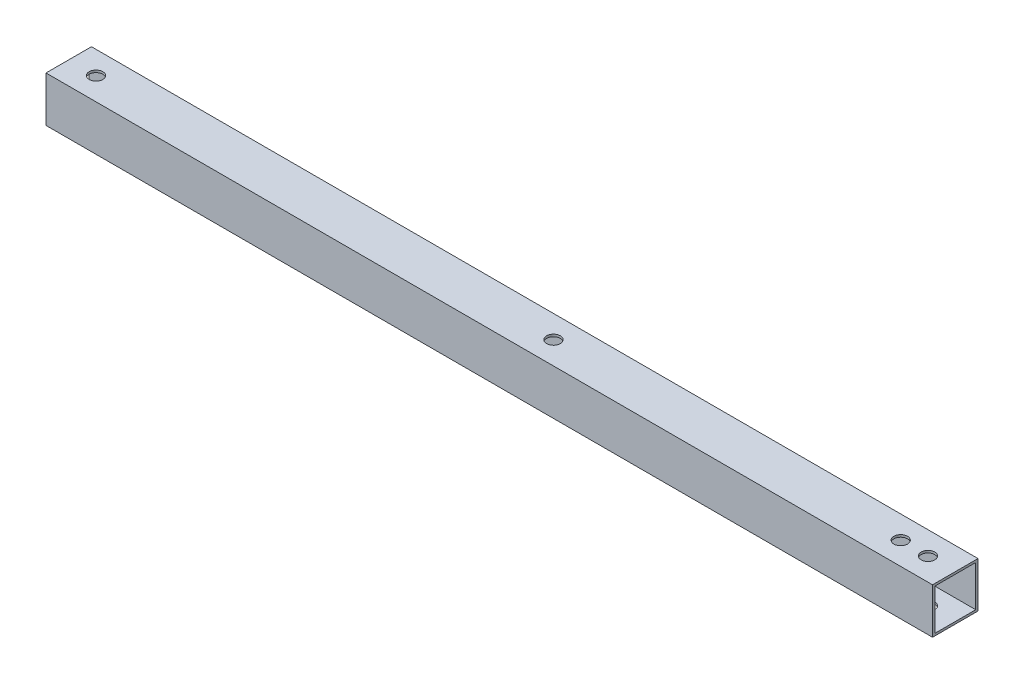
ISO-10303-21;
HEADER;
FILE_DESCRIPTION(('STEP AP214'),'2;1');
FILE_NAME('part.step','',(''),(''),'','','');
FILE_SCHEMA(('AUTOMOTIVE_DESIGN { 1 0 10303 214 1 1 1 1 }'));
ENDSEC;
DATA;
#1=APPLICATION_CONTEXT('core data for automotive mechanical design processes');
#2=APPLICATION_PROTOCOL_DEFINITION('international standard','automotive_design',2000,#1);
#3=PRODUCT_CONTEXT('',#1,'mechanical');
#4=PRODUCT('Part','Part','',(#3));
#5=PRODUCT_RELATED_PRODUCT_CATEGORY('part','',(#4));
#6=PRODUCT_DEFINITION_FORMATION('','',#4);
#7=PRODUCT_DEFINITION_CONTEXT('part definition',#1,'design');
#8=PRODUCT_DEFINITION('design','',#6,#7);
#9=PRODUCT_DEFINITION_SHAPE('','',#8);
#10=(LENGTH_UNIT() NAMED_UNIT(*) SI_UNIT(.MILLI.,.METRE.));
#11=(NAMED_UNIT(*) PLANE_ANGLE_UNIT() SI_UNIT($,.RADIAN.));
#12=(NAMED_UNIT(*) SI_UNIT($,.STERADIAN.) SOLID_ANGLE_UNIT());
#13=UNCERTAINTY_MEASURE_WITH_UNIT(LENGTH_MEASURE(1.E-05),#10,'distance_accuracy_value','');
#14=(GEOMETRIC_REPRESENTATION_CONTEXT(3) GLOBAL_UNCERTAINTY_ASSIGNED_CONTEXT((#13)) GLOBAL_UNIT_ASSIGNED_CONTEXT((#10,
#11,#12)) REPRESENTATION_CONTEXT('',''));
#15=CARTESIAN_POINT('',(0.,0.,0.));
#16=DIRECTION('',(0.,0.,1.));
#17=DIRECTION('',(1.,0.,0.));
#18=AXIS2_PLACEMENT_3D('',#15,#16,#17);
#19=CARTESIAN_POINT('',(390.,0.,0.));
#20=DIRECTION('',(-1.,0.,0.));
#21=DIRECTION('',(0.,0.,1.));
#22=AXIS2_PLACEMENT_3D('',#19,#20,#21);
#23=PLANE('',#22);
#24=DIRECTION('',(0.,1.,0.));
#25=VECTOR('',#24,1.);
#26=CARTESIAN_POINT('',(390.,-10.,-10.));
#27=LINE('',#26,#25);
#28=CARTESIAN_POINT('',(390.,-10.,-10.));
#29=VERTEX_POINT('',#28);
#30=CARTESIAN_POINT('',(390.,10.,-10.));
#31=VERTEX_POINT('',#30);
#32=EDGE_CURVE('E157',#29,#31,#27,.T.);
#33=ORIENTED_EDGE('',*,*,#32,.T.);
#34=DIRECTION('',(0.,0.,1.));
#35=VECTOR('',#34,1.);
#36=CARTESIAN_POINT('',(390.,10.,10.));
#37=LINE('',#36,#35);
#38=CARTESIAN_POINT('',(390.,10.,10.));
#39=VERTEX_POINT('',#38);
#40=EDGE_CURVE('E161',#31,#39,#37,.T.);
#41=ORIENTED_EDGE('',*,*,#40,.T.);
#42=DIRECTION('',(0.,-1.,0.));
#43=VECTOR('',#42,1.);
#44=CARTESIAN_POINT('',(390.,-10.,10.));
#45=LINE('',#44,#43);
#46=CARTESIAN_POINT('',(390.,-10.,10.));
#47=VERTEX_POINT('',#46);
#48=EDGE_CURVE('E165',#39,#47,#45,.T.);
#49=ORIENTED_EDGE('',*,*,#48,.T.);
#50=DIRECTION('',(0.,0.,-1.));
#51=VECTOR('',#50,1.);
#52=CARTESIAN_POINT('',(390.,-10.,10.));
#53=LINE('',#52,#51);
#54=EDGE_CURVE('E168',#47,#29,#53,.T.);
#55=ORIENTED_EDGE('',*,*,#54,.T.);
#56=EDGE_LOOP('',(#33,#41,#49,#55));
#57=FACE_BOUND('',#56,.T.);
#58=DIRECTION('',(0.,-1.,0.));
#59=VECTOR('',#58,1.);
#60=CARTESIAN_POINT('',(390.,-9.,9.00000000000001));
#61=LINE('',#60,#59);
#62=CARTESIAN_POINT('',(390.,9.,9.00000000000001));
#63=VERTEX_POINT('',#62);
#64=CARTESIAN_POINT('',(390.,-9.,9.00000000000001));
#65=VERTEX_POINT('',#64);
#66=EDGE_CURVE('E107',#63,#65,#61,.T.);
#67=ORIENTED_EDGE('',*,*,#66,.F.);
#68=DIRECTION('',(0.,0.,1.));
#69=VECTOR('',#68,1.);
#70=CARTESIAN_POINT('',(390.,9.,9.00000000000001));
#71=LINE('',#70,#69);
#72=CARTESIAN_POINT('',(390.,9.,-9.));
#73=VERTEX_POINT('',#72);
#74=EDGE_CURVE('E133',#73,#63,#71,.T.);
#75=ORIENTED_EDGE('',*,*,#74,.F.);
#76=DIRECTION('',(0.,1.,0.));
#77=VECTOR('',#76,1.);
#78=CARTESIAN_POINT('',(390.,-9.,-9.));
#79=LINE('',#78,#77);
#80=CARTESIAN_POINT('',(390.,-9.,-9.));
#81=VERTEX_POINT('',#80);
#82=EDGE_CURVE('E129',#81,#73,#79,.T.);
#83=ORIENTED_EDGE('',*,*,#82,.F.);
#84=DIRECTION('',(0.,0.,-1.));
#85=VECTOR('',#84,1.);
#86=CARTESIAN_POINT('',(390.,-9.,9.00000000000001));
#87=LINE('',#86,#85);
#88=EDGE_CURVE('E116',#65,#81,#87,.T.);
#89=ORIENTED_EDGE('',*,*,#88,.F.);
#90=EDGE_LOOP('',(#67,#75,#83,#89));
#91=FACE_BOUND('',#90,.T.);
#92=ADVANCED_FACE('F39',(#57,#91),#23,.F.);
#93=CARTESIAN_POINT('',(0.,0.,0.));
#94=DIRECTION('',(-1.,0.,0.));
#95=DIRECTION('',(0.,0.,1.));
#96=AXIS2_PLACEMENT_3D('',#93,#94,#95);
#97=PLANE('',#96);
#98=DIRECTION('',(0.,1.,0.));
#99=VECTOR('',#98,1.);
#100=CARTESIAN_POINT('',(0.,-10.,-10.));
#101=LINE('',#100,#99);
#102=CARTESIAN_POINT('',(0.,-10.,-10.));
#103=VERTEX_POINT('',#102);
#104=CARTESIAN_POINT('',(0.,10.,-10.));
#105=VERTEX_POINT('',#104);
#106=EDGE_CURVE('E125',#103,#105,#101,.T.);
#107=ORIENTED_EDGE('',*,*,#106,.F.);
#108=DIRECTION('',(0.,0.,-1.));
#109=VECTOR('',#108,1.);
#110=CARTESIAN_POINT('',(0.,-10.,10.));
#111=LINE('',#110,#109);
#112=CARTESIAN_POINT('',(0.,-10.,10.));
#113=VERTEX_POINT('',#112);
#114=EDGE_CURVE('E162',#113,#103,#111,.T.);
#115=ORIENTED_EDGE('',*,*,#114,.F.);
#116=DIRECTION('',(0.,-1.,0.));
#117=VECTOR('',#116,1.);
#118=CARTESIAN_POINT('',(0.,-10.,10.));
#119=LINE('',#118,#117);
#120=CARTESIAN_POINT('',(0.,10.,10.));
#121=VERTEX_POINT('',#120);
#122=EDGE_CURVE('E178',#121,#113,#119,.T.);
#123=ORIENTED_EDGE('',*,*,#122,.F.);
#124=DIRECTION('',(0.,0.,1.));
#125=VECTOR('',#124,1.);
#126=CARTESIAN_POINT('',(0.,10.,10.));
#127=LINE('',#126,#125);
#128=EDGE_CURVE('E175',#105,#121,#127,.T.);
#129=ORIENTED_EDGE('',*,*,#128,.F.);
#130=EDGE_LOOP('',(#107,#115,#123,#129));
#131=FACE_BOUND('',#130,.T.);
#132=DIRECTION('',(0.,0.,1.));
#133=VECTOR('',#132,1.);
#134=CARTESIAN_POINT('',(0.,9.,9.00000000000001));
#135=LINE('',#134,#133);
#136=CARTESIAN_POINT('',(0.,9.,-9.));
#137=VERTEX_POINT('',#136);
#138=CARTESIAN_POINT('',(0.,9.,9.00000000000001));
#139=VERTEX_POINT('',#138);
#140=EDGE_CURVE('E117',#137,#139,#135,.T.);
#141=ORIENTED_EDGE('',*,*,#140,.T.);
#142=DIRECTION('',(0.,-1.,0.));
#143=VECTOR('',#142,1.);
#144=CARTESIAN_POINT('',(0.,-9.,9.00000000000001));
#145=LINE('',#144,#143);
#146=CARTESIAN_POINT('',(0.,-9.,9.00000000000001));
#147=VERTEX_POINT('',#146);
#148=EDGE_CURVE('E65',#139,#147,#145,.T.);
#149=ORIENTED_EDGE('',*,*,#148,.T.);
#150=DIRECTION('',(0.,0.,-1.));
#151=VECTOR('',#150,1.);
#152=CARTESIAN_POINT('',(0.,-9.,9.00000000000001));
#153=LINE('',#152,#151);
#154=CARTESIAN_POINT('',(0.,-9.,-9.));
#155=VERTEX_POINT('',#154);
#156=EDGE_CURVE('E123',#147,#155,#153,.T.);
#157=ORIENTED_EDGE('',*,*,#156,.T.);
#158=DIRECTION('',(0.,1.,0.));
#159=VECTOR('',#158,1.);
#160=CARTESIAN_POINT('',(0.,-9.,-9.));
#161=LINE('',#160,#159);
#162=EDGE_CURVE('E144',#155,#137,#161,.T.);
#163=ORIENTED_EDGE('',*,*,#162,.T.);
#164=EDGE_LOOP('',(#141,#149,#157,#163));
#165=FACE_BOUND('',#164,.T.);
#166=ADVANCED_FACE('F255',(#131,#165),#97,.T.);
#167=CARTESIAN_POINT('',(390.,-10.,-10.));
#168=DIRECTION('',(0.,0.,1.));
#169=DIRECTION('',(1.,0.,0.));
#170=AXIS2_PLACEMENT_3D('',#167,#168,#169);
#171=PLANE('',#170);
#172=ORIENTED_EDGE('',*,*,#106,.T.);
#173=DIRECTION('',(-1.,0.,0.));
#174=VECTOR('',#173,1.);
#175=CARTESIAN_POINT('',(390.,10.,-10.));
#176=LINE('',#175,#174);
#177=EDGE_CURVE('E11',#31,#105,#176,.T.);
#178=ORIENTED_EDGE('',*,*,#177,.F.);
#179=ORIENTED_EDGE('',*,*,#32,.F.);
#180=DIRECTION('',(-1.,0.,0.));
#181=VECTOR('',#180,1.);
#182=CARTESIAN_POINT('',(390.,-10.,-10.));
#183=LINE('',#182,#181);
#184=EDGE_CURVE('E171',#29,#103,#183,.T.);
#185=ORIENTED_EDGE('',*,*,#184,.T.);
#186=EDGE_LOOP('',(#172,#178,#179,#185));
#187=FACE_BOUND('',#186,.T.);
#188=ADVANCED_FACE('F41',(#187),#171,.F.);
#189=CARTESIAN_POINT('',(390.,10.,10.));
#190=DIRECTION('',(0.,-1.,0.));
#191=DIRECTION('',(0.,0.,-1.));
#192=AXIS2_PLACEMENT_3D('',#189,#190,#191);
#193=PLANE('',#192);
#194=CARTESIAN_POINT('',(12.,10.,0.));
#195=DIRECTION('',(0.,1.,0.));
#196=DIRECTION('',(0.,0.,1.));
#197=AXIS2_PLACEMENT_3D('',#194,#195,#196);
#198=CIRCLE('',#197,3.);
#199=CARTESIAN_POINT('',(12.,10.,3.));
#200=VERTEX_POINT('',#199);
#201=EDGE_CURVE('E198',#200,#200,#198,.T.);
#202=ORIENTED_EDGE('',*,*,#201,.F.);
#203=EDGE_LOOP('',(#202));
#204=FACE_BOUND('',#203,.T.);
#205=CARTESIAN_POINT('',(366.,10.,0.));
#206=DIRECTION('',(0.,1.,0.));
#207=DIRECTION('',(0.,0.,-1.));
#208=AXIS2_PLACEMENT_3D('',#205,#206,#207);
#209=CIRCLE('',#208,2.99999999999999);
#210=CARTESIAN_POINT('',(366.,10.,-2.99999999999999));
#211=VERTEX_POINT('',#210);
#212=EDGE_CURVE('E284',#211,#211,#209,.T.);
#213=ORIENTED_EDGE('',*,*,#212,.F.);
#214=EDGE_LOOP('',(#213));
#215=FACE_BOUND('',#214,.T.);
#216=CARTESIAN_POINT('',(378.,10.,0.));
#217=DIRECTION('',(0.,1.,0.));
#218=DIRECTION('',(0.,0.,-1.));
#219=AXIS2_PLACEMENT_3D('',#216,#217,#218);
#220=CIRCLE('',#219,2.99999999999999);
#221=CARTESIAN_POINT('',(378.,10.,-2.99999999999999));
#222=VERTEX_POINT('',#221);
#223=EDGE_CURVE('E288',#222,#222,#220,.T.);
#224=ORIENTED_EDGE('',*,*,#223,.F.);
#225=EDGE_LOOP('',(#224));
#226=FACE_BOUND('',#225,.T.);
#227=CARTESIAN_POINT('',(213.25,10.,0.));
#228=DIRECTION('',(0.,1.,0.));
#229=DIRECTION('',(0.,0.,1.));
#230=AXIS2_PLACEMENT_3D('',#227,#228,#229);
#231=CIRCLE('',#230,2.99999999999999);
#232=CARTESIAN_POINT('',(213.25,10.,2.99999999999998));
#233=VERTEX_POINT('',#232);
#234=EDGE_CURVE('E292',#233,#233,#231,.T.);
#235=ORIENTED_EDGE('',*,*,#234,.F.);
#236=EDGE_LOOP('',(#235));
#237=FACE_BOUND('',#236,.T.);
#238=ORIENTED_EDGE('',*,*,#128,.T.);
#239=DIRECTION('',(-1.,0.,0.));
#240=VECTOR('',#239,1.);
#241=CARTESIAN_POINT('',(390.,10.,10.));
#242=LINE('',#241,#240);
#243=EDGE_CURVE('E49',#39,#121,#242,.T.);
#244=ORIENTED_EDGE('',*,*,#243,.F.);
#245=ORIENTED_EDGE('',*,*,#40,.F.);
#246=ORIENTED_EDGE('',*,*,#177,.T.);
#247=EDGE_LOOP('',(#238,#244,#245,#246));
#248=FACE_BOUND('',#247,.T.);
#249=ADVANCED_FACE('F270',(#204,#215,#226,#237,#248),#193,.F.);
#250=CARTESIAN_POINT('',(390.,-10.,10.));
#251=DIRECTION('',(0.,0.,-1.));
#252=DIRECTION('',(-1.,0.,0.));
#253=AXIS2_PLACEMENT_3D('',#250,#251,#252);
#254=PLANE('',#253);
#255=ORIENTED_EDGE('',*,*,#122,.T.);
#256=DIRECTION('',(-1.,0.,0.));
#257=VECTOR('',#256,1.);
#258=CARTESIAN_POINT('',(390.,-10.,10.));
#259=LINE('',#258,#257);
#260=EDGE_CURVE('E186',#47,#113,#259,.T.);
#261=ORIENTED_EDGE('',*,*,#260,.F.);
#262=ORIENTED_EDGE('',*,*,#48,.F.);
#263=ORIENTED_EDGE('',*,*,#243,.T.);
#264=EDGE_LOOP('',(#255,#261,#262,#263));
#265=FACE_BOUND('',#264,.T.);
#266=ADVANCED_FACE('F268',(#265),#254,.F.);
#267=CARTESIAN_POINT('',(390.,-10.,10.));
#268=DIRECTION('',(0.,1.,0.));
#269=DIRECTION('',(0.,0.,1.));
#270=AXIS2_PLACEMENT_3D('',#267,#268,#269);
#271=PLANE('',#270);
#272=CARTESIAN_POINT('',(12.,-10.,0.));
#273=DIRECTION('',(0.,1.,0.));
#274=DIRECTION('',(0.,0.,1.));
#275=AXIS2_PLACEMENT_3D('',#272,#273,#274);
#276=CIRCLE('',#275,3.);
#277=CARTESIAN_POINT('',(12.,-10.,3.));
#278=VERTEX_POINT('',#277);
#279=EDGE_CURVE('E141',#278,#278,#276,.T.);
#280=ORIENTED_EDGE('',*,*,#279,.T.);
#281=EDGE_LOOP('',(#280));
#282=FACE_BOUND('',#281,.T.);
#283=CARTESIAN_POINT('',(366.,-10.,0.));
#284=DIRECTION('',(0.,1.,0.));
#285=DIRECTION('',(0.,0.,1.));
#286=AXIS2_PLACEMENT_3D('',#283,#284,#285);
#287=CIRCLE('',#286,2.99999999999999);
#288=CARTESIAN_POINT('',(366.,-10.,2.99999999999999));
#289=VERTEX_POINT('',#288);
#290=EDGE_CURVE('E214',#289,#289,#287,.T.);
#291=ORIENTED_EDGE('',*,*,#290,.T.);
#292=EDGE_LOOP('',(#291));
#293=FACE_BOUND('',#292,.T.);
#294=CARTESIAN_POINT('',(378.,-10.,0.));
#295=DIRECTION('',(0.,1.,0.));
#296=DIRECTION('',(0.,0.,1.));
#297=AXIS2_PLACEMENT_3D('',#294,#295,#296);
#298=CIRCLE('',#297,2.99999999999999);
#299=CARTESIAN_POINT('',(378.,-10.,2.99999999999999));
#300=VERTEX_POINT('',#299);
#301=EDGE_CURVE('E208',#300,#300,#298,.T.);
#302=ORIENTED_EDGE('',*,*,#301,.T.);
#303=EDGE_LOOP('',(#302));
#304=FACE_BOUND('',#303,.T.);
#305=CARTESIAN_POINT('',(213.25,-10.,0.));
#306=DIRECTION('',(0.,1.,0.));
#307=DIRECTION('',(0.,0.,1.));
#308=AXIS2_PLACEMENT_3D('',#305,#306,#307);
#309=CIRCLE('',#308,2.99999999999999);
#310=CARTESIAN_POINT('',(213.25,-10.,2.99999999999998));
#311=VERTEX_POINT('',#310);
#312=EDGE_CURVE('E203',#311,#311,#309,.T.);
#313=ORIENTED_EDGE('',*,*,#312,.T.);
#314=EDGE_LOOP('',(#313));
#315=FACE_BOUND('',#314,.T.);
#316=ORIENTED_EDGE('',*,*,#114,.T.);
#317=ORIENTED_EDGE('',*,*,#184,.F.);
#318=ORIENTED_EDGE('',*,*,#54,.F.);
#319=ORIENTED_EDGE('',*,*,#260,.T.);
#320=EDGE_LOOP('',(#316,#317,#318,#319));
#321=FACE_BOUND('',#320,.T.);
#322=ADVANCED_FACE('F235',(#282,#293,#304,#315,#321),#271,.F.);
#323=CARTESIAN_POINT('',(390.,-9.,9.00000000000001));
#324=DIRECTION('',(0.,0.,-1.));
#325=DIRECTION('',(-1.,0.,0.));
#326=AXIS2_PLACEMENT_3D('',#323,#324,#325);
#327=PLANE('',#326);
#328=ORIENTED_EDGE('',*,*,#148,.F.);
#329=DIRECTION('',(-1.,0.,0.));
#330=VECTOR('',#329,1.);
#331=CARTESIAN_POINT('',(390.,9.,9.00000000000001));
#332=LINE('',#331,#330);
#333=EDGE_CURVE('E111',#63,#139,#332,.T.);
#334=ORIENTED_EDGE('',*,*,#333,.F.);
#335=ORIENTED_EDGE('',*,*,#66,.T.);
#336=DIRECTION('',(-1.,0.,0.));
#337=VECTOR('',#336,1.);
#338=CARTESIAN_POINT('',(390.,-9.,9.00000000000001));
#339=LINE('',#338,#337);
#340=EDGE_CURVE('E110',#65,#147,#339,.T.);
#341=ORIENTED_EDGE('',*,*,#340,.T.);
#342=EDGE_LOOP('',(#328,#334,#335,#341));
#343=FACE_BOUND('',#342,.T.);
#344=ADVANCED_FACE('F109',(#343),#327,.T.);
#345=CARTESIAN_POINT('',(390.,-9.,9.00000000000001));
#346=DIRECTION('',(0.,1.,0.));
#347=DIRECTION('',(0.,0.,1.));
#348=AXIS2_PLACEMENT_3D('',#345,#346,#347);
#349=PLANE('',#348);
#350=CARTESIAN_POINT('',(12.,-8.9999999999999,0.));
#351=DIRECTION('',(0.,1.,0.));
#352=DIRECTION('',(0.,0.,1.));
#353=AXIS2_PLACEMENT_3D('',#350,#351,#352);
#354=CIRCLE('',#353,3.);
#355=CARTESIAN_POINT('',(12.,-8.9999999999999,3.));
#356=VERTEX_POINT('',#355);
#357=EDGE_CURVE('E228',#356,#356,#354,.T.);
#358=ORIENTED_EDGE('',*,*,#357,.F.);
#359=EDGE_LOOP('',(#358));
#360=FACE_BOUND('',#359,.T.);
#361=CARTESIAN_POINT('',(366.,-8.9999999999999,0.));
#362=DIRECTION('',(0.,1.,0.));
#363=DIRECTION('',(0.,0.,1.));
#364=AXIS2_PLACEMENT_3D('',#361,#362,#363);
#365=CIRCLE('',#364,2.99999999999999);
#366=CARTESIAN_POINT('',(366.,-8.9999999999999,2.99999999999999));
#367=VERTEX_POINT('',#366);
#368=EDGE_CURVE('E207',#367,#367,#365,.T.);
#369=ORIENTED_EDGE('',*,*,#368,.F.);
#370=EDGE_LOOP('',(#369));
#371=FACE_BOUND('',#370,.T.);
#372=CARTESIAN_POINT('',(378.,-8.9999999999999,0.));
#373=DIRECTION('',(0.,1.,0.));
#374=DIRECTION('',(0.,0.,1.));
#375=AXIS2_PLACEMENT_3D('',#372,#373,#374);
#376=CIRCLE('',#375,2.99999999999999);
#377=CARTESIAN_POINT('',(378.,-8.9999999999999,2.99999999999999));
#378=VERTEX_POINT('',#377);
#379=EDGE_CURVE('E202',#378,#378,#376,.T.);
#380=ORIENTED_EDGE('',*,*,#379,.F.);
#381=EDGE_LOOP('',(#380));
#382=FACE_BOUND('',#381,.T.);
#383=CARTESIAN_POINT('',(213.25,-8.9999999999999,0.));
#384=DIRECTION('',(0.,1.,0.));
#385=DIRECTION('',(0.,0.,1.));
#386=AXIS2_PLACEMENT_3D('',#383,#384,#385);
#387=CIRCLE('',#386,2.99999999999999);
#388=CARTESIAN_POINT('',(213.25,-8.9999999999999,2.99999999999998));
#389=VERTEX_POINT('',#388);
#390=EDGE_CURVE('E197',#389,#389,#387,.T.);
#391=ORIENTED_EDGE('',*,*,#390,.F.);
#392=EDGE_LOOP('',(#391));
#393=FACE_BOUND('',#392,.T.);
#394=ORIENTED_EDGE('',*,*,#156,.F.);
#395=ORIENTED_EDGE('',*,*,#340,.F.);
#396=ORIENTED_EDGE('',*,*,#88,.T.);
#397=DIRECTION('',(-1.,0.,0.));
#398=VECTOR('',#397,1.);
#399=CARTESIAN_POINT('',(390.,-9.,-9.));
#400=LINE('',#399,#398);
#401=EDGE_CURVE('E126',#81,#155,#400,.T.);
#402=ORIENTED_EDGE('',*,*,#401,.T.);
#403=EDGE_LOOP('',(#394,#395,#396,#402));
#404=FACE_BOUND('',#403,.T.);
#405=ADVANCED_FACE('F120',(#360,#371,#382,#393,#404),#349,.T.);
#406=CARTESIAN_POINT('',(390.,-9.,-9.));
#407=DIRECTION('',(0.,0.,1.));
#408=DIRECTION('',(0.,-1.,0.));
#409=AXIS2_PLACEMENT_3D('',#406,#407,#408);
#410=PLANE('',#409);
#411=ORIENTED_EDGE('',*,*,#162,.F.);
#412=ORIENTED_EDGE('',*,*,#401,.F.);
#413=ORIENTED_EDGE('',*,*,#82,.T.);
#414=DIRECTION('',(-1.,0.,0.));
#415=VECTOR('',#414,1.);
#416=CARTESIAN_POINT('',(390.,9.,-9.));
#417=LINE('',#416,#415);
#418=EDGE_CURVE('E57',#73,#137,#417,.T.);
#419=ORIENTED_EDGE('',*,*,#418,.T.);
#420=EDGE_LOOP('',(#411,#412,#413,#419));
#421=FACE_BOUND('',#420,.T.);
#422=ADVANCED_FACE('F309',(#421),#410,.T.);
#423=CARTESIAN_POINT('',(390.,9.,9.00000000000001));
#424=DIRECTION('',(0.,-1.,0.));
#425=DIRECTION('',(0.,0.,-1.));
#426=AXIS2_PLACEMENT_3D('',#423,#424,#425);
#427=PLANE('',#426);
#428=CARTESIAN_POINT('',(12.,8.9999999999999,0.));
#429=DIRECTION('',(0.,-1.,0.));
#430=DIRECTION('',(0.,0.,-1.));
#431=AXIS2_PLACEMENT_3D('',#428,#429,#430);
#432=CIRCLE('',#431,3.);
#433=CARTESIAN_POINT('',(12.,8.9999999999999,-3.));
#434=VERTEX_POINT('',#433);
#435=EDGE_CURVE('E43',#434,#434,#432,.T.);
#436=ORIENTED_EDGE('',*,*,#435,.F.);
#437=EDGE_LOOP('',(#436));
#438=FACE_BOUND('',#437,.T.);
#439=CARTESIAN_POINT('',(366.,8.9999999999999,0.));
#440=DIRECTION('',(0.,-1.,0.));
#441=DIRECTION('',(0.,0.,-1.));
#442=AXIS2_PLACEMENT_3D('',#439,#440,#441);
#443=CIRCLE('',#442,2.99999999999999);
#444=CARTESIAN_POINT('',(366.,8.9999999999999,-2.99999999999999));
#445=VERTEX_POINT('',#444);
#446=EDGE_CURVE('E204',#445,#445,#443,.T.);
#447=ORIENTED_EDGE('',*,*,#446,.F.);
#448=EDGE_LOOP('',(#447));
#449=FACE_BOUND('',#448,.T.);
#450=CARTESIAN_POINT('',(378.,8.9999999999999,0.));
#451=DIRECTION('',(0.,-1.,0.));
#452=DIRECTION('',(0.,0.,-1.));
#453=AXIS2_PLACEMENT_3D('',#450,#451,#452);
#454=CIRCLE('',#453,2.99999999999999);
#455=CARTESIAN_POINT('',(378.,8.9999999999999,-2.99999999999999));
#456=VERTEX_POINT('',#455);
#457=EDGE_CURVE('E199',#456,#456,#454,.T.);
#458=ORIENTED_EDGE('',*,*,#457,.F.);
#459=EDGE_LOOP('',(#458));
#460=FACE_BOUND('',#459,.T.);
#461=CARTESIAN_POINT('',(213.25,8.9999999999999,0.));
#462=DIRECTION('',(0.,-1.,0.));
#463=DIRECTION('',(0.,0.,-1.));
#464=AXIS2_PLACEMENT_3D('',#461,#462,#463);
#465=CIRCLE('',#464,2.99999999999999);
#466=CARTESIAN_POINT('',(213.25,8.9999999999999,-3.00000000000001));
#467=VERTEX_POINT('',#466);
#468=EDGE_CURVE('E193',#467,#467,#465,.T.);
#469=ORIENTED_EDGE('',*,*,#468,.F.);
#470=EDGE_LOOP('',(#469));
#471=FACE_BOUND('',#470,.T.);
#472=ORIENTED_EDGE('',*,*,#140,.F.);
#473=ORIENTED_EDGE('',*,*,#418,.F.);
#474=ORIENTED_EDGE('',*,*,#74,.T.);
#475=ORIENTED_EDGE('',*,*,#333,.T.);
#476=EDGE_LOOP('',(#472,#473,#474,#475));
#477=FACE_BOUND('',#476,.T.);
#478=ADVANCED_FACE('F306',(#438,#449,#460,#471,#477),#427,.T.);
#479=CARTESIAN_POINT('',(213.25,-1230.,0.));
#480=DIRECTION('',(0.,1.,0.));
#481=DIRECTION('',(0.,0.,1.));
#482=AXIS2_PLACEMENT_3D('',#479,#480,#481);
#483=CYLINDRICAL_SURFACE('',#482,2.99999999999999);
#484=ORIENTED_EDGE('',*,*,#468,.T.);
#485=EDGE_LOOP('',(#484));
#486=FACE_BOUND('',#485,.T.);
#487=ORIENTED_EDGE('',*,*,#234,.T.);
#488=EDGE_LOOP('',(#487));
#489=FACE_BOUND('',#488,.T.);
#490=ADVANCED_FACE('F308',(#486,#489),#483,.F.);
#491=CARTESIAN_POINT('',(378.,-1230.,0.));
#492=DIRECTION('',(0.,1.,0.));
#493=DIRECTION('',(0.,0.,1.));
#494=AXIS2_PLACEMENT_3D('',#491,#492,#493);
#495=CYLINDRICAL_SURFACE('',#494,2.99999999999999);
#496=ORIENTED_EDGE('',*,*,#457,.T.);
#497=EDGE_LOOP('',(#496));
#498=FACE_BOUND('',#497,.T.);
#499=ORIENTED_EDGE('',*,*,#223,.T.);
#500=EDGE_LOOP('',(#499));
#501=FACE_BOUND('',#500,.T.);
#502=ADVANCED_FACE('F316',(#498,#501),#495,.F.);
#503=CARTESIAN_POINT('',(366.,-1230.,0.));
#504=DIRECTION('',(0.,1.,0.));
#505=DIRECTION('',(0.,0.,1.));
#506=AXIS2_PLACEMENT_3D('',#503,#504,#505);
#507=CYLINDRICAL_SURFACE('',#506,2.99999999999999);
#508=ORIENTED_EDGE('',*,*,#446,.T.);
#509=EDGE_LOOP('',(#508));
#510=FACE_BOUND('',#509,.T.);
#511=ORIENTED_EDGE('',*,*,#212,.T.);
#512=EDGE_LOOP('',(#511));
#513=FACE_BOUND('',#512,.T.);
#514=ADVANCED_FACE('F250',(#510,#513),#507,.F.);
#515=CARTESIAN_POINT('',(12.,-1230.,0.));
#516=DIRECTION('',(0.,1.,0.));
#517=DIRECTION('',(0.,0.,1.));
#518=AXIS2_PLACEMENT_3D('',#515,#516,#517);
#519=CYLINDRICAL_SURFACE('',#518,3.);
#520=ORIENTED_EDGE('',*,*,#435,.T.);
#521=EDGE_LOOP('',(#520));
#522=FACE_BOUND('',#521,.T.);
#523=ORIENTED_EDGE('',*,*,#201,.T.);
#524=EDGE_LOOP('',(#523));
#525=FACE_BOUND('',#524,.T.);
#526=ADVANCED_FACE('F243',(#522,#525),#519,.F.);
#527=ORIENTED_EDGE('',*,*,#390,.T.);
#528=EDGE_LOOP('',(#527));
#529=FACE_BOUND('',#528,.T.);
#530=ORIENTED_EDGE('',*,*,#312,.F.);
#531=EDGE_LOOP('',(#530));
#532=FACE_BOUND('',#531,.T.);
#533=ADVANCED_FACE('F252',(#529,#532),#483,.F.);
#534=ORIENTED_EDGE('',*,*,#379,.T.);
#535=EDGE_LOOP('',(#534));
#536=FACE_BOUND('',#535,.T.);
#537=ORIENTED_EDGE('',*,*,#301,.F.);
#538=EDGE_LOOP('',(#537));
#539=FACE_BOUND('',#538,.T.);
#540=ADVANCED_FACE('F247',(#536,#539),#495,.F.);
#541=ORIENTED_EDGE('',*,*,#368,.T.);
#542=EDGE_LOOP('',(#541));
#543=FACE_BOUND('',#542,.T.);
#544=ORIENTED_EDGE('',*,*,#290,.F.);
#545=EDGE_LOOP('',(#544));
#546=FACE_BOUND('',#545,.T.);
#547=ADVANCED_FACE('F240',(#543,#546),#507,.F.);
#548=ORIENTED_EDGE('',*,*,#357,.T.);
#549=EDGE_LOOP('',(#548));
#550=FACE_BOUND('',#549,.T.);
#551=ORIENTED_EDGE('',*,*,#279,.F.);
#552=EDGE_LOOP('',(#551));
#553=FACE_BOUND('',#552,.T.);
#554=ADVANCED_FACE('F238',(#550,#553),#519,.F.);
#555=CLOSED_SHELL('',(#92,#166,#188,#249,#266,#322,#344,#405,#422,#478,#490,#502,#514,#526,#533,
#540,#547,#554));
#556=MANIFOLD_SOLID_BREP('B2',#555);
#557=ADVANCED_BREP_SHAPE_REPRESENTATION('',(#18,#556),#14);
#558=SHAPE_DEFINITION_REPRESENTATION(#9,#557);
ENDSEC;
END-ISO-10303-21;
